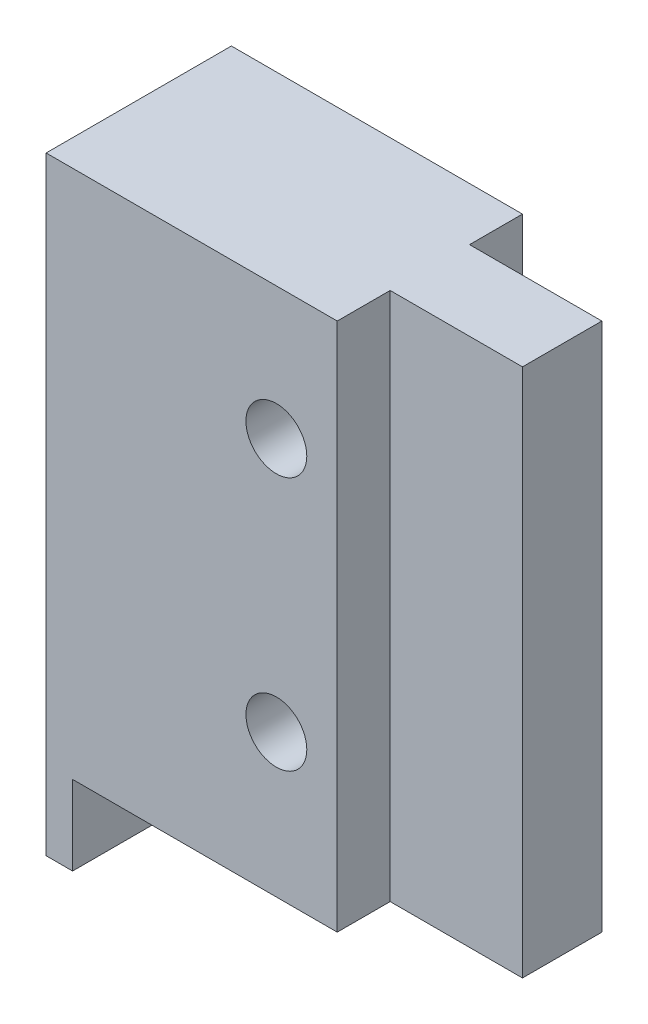
ISO-10303-21;
HEADER;
FILE_DESCRIPTION(('STEP AP214'),'2;1');
FILE_NAME('part.step','',(''),(''),'','','');
FILE_SCHEMA(('AUTOMOTIVE_DESIGN { 1 0 10303 214 1 1 1 1 }'));
ENDSEC;
DATA;
#1=APPLICATION_CONTEXT('core data for automotive mechanical design processes');
#2=APPLICATION_PROTOCOL_DEFINITION('international standard','automotive_design',2000,#1);
#3=PRODUCT_CONTEXT('',#1,'mechanical');
#4=PRODUCT('Part','Part','',(#3));
#5=PRODUCT_RELATED_PRODUCT_CATEGORY('part','',(#4));
#6=PRODUCT_DEFINITION_FORMATION('','',#4);
#7=PRODUCT_DEFINITION_CONTEXT('part definition',#1,'design');
#8=PRODUCT_DEFINITION('design','',#6,#7);
#9=PRODUCT_DEFINITION_SHAPE('','',#8);
#10=(LENGTH_UNIT() NAMED_UNIT(*) SI_UNIT(.MILLI.,.METRE.));
#11=(NAMED_UNIT(*) PLANE_ANGLE_UNIT() SI_UNIT($,.RADIAN.));
#12=(NAMED_UNIT(*) SI_UNIT($,.STERADIAN.) SOLID_ANGLE_UNIT());
#13=UNCERTAINTY_MEASURE_WITH_UNIT(LENGTH_MEASURE(1.E-05),#10,'distance_accuracy_value','');
#14=(GEOMETRIC_REPRESENTATION_CONTEXT(3) GLOBAL_UNCERTAINTY_ASSIGNED_CONTEXT((#13)) GLOBAL_UNIT_ASSIGNED_CONTEXT((#10,
#11,#12)) REPRESENTATION_CONTEXT('',''));
#15=CARTESIAN_POINT('',(0.,0.,0.));
#16=DIRECTION('',(0.,0.,1.));
#17=DIRECTION('',(1.,0.,0.));
#18=AXIS2_PLACEMENT_3D('',#15,#16,#17);
#19=CARTESIAN_POINT('',(11.,0.,-3.5));
#20=DIRECTION('',(-1.,0.,0.));
#21=DIRECTION('',(0.,-1.,0.));
#22=AXIS2_PLACEMENT_3D('',#19,#20,#21);
#23=PLANE('',#22);
#24=DIRECTION('',(0.,-1.,0.));
#25=VECTOR('',#24,1.);
#26=CARTESIAN_POINT('',(11.,0.,1.5));
#27=LINE('',#26,#25);
#28=CARTESIAN_POINT('',(11.,23.,1.5));
#29=VERTEX_POINT('',#28);
#30=CARTESIAN_POINT('',(11.,3.,1.5));
#31=VERTEX_POINT('',#30);
#32=EDGE_CURVE('E128',#29,#31,#27,.T.);
#33=ORIENTED_EDGE('',*,*,#32,.F.);
#34=DIRECTION('',(0.,0.,1.));
#35=VECTOR('',#34,1.);
#36=CARTESIAN_POINT('',(11.,23.,-3.5));
#37=LINE('',#36,#35);
#38=CARTESIAN_POINT('',(11.,23.,3.5));
#39=VERTEX_POINT('',#38);
#40=EDGE_CURVE('E140',#29,#39,#37,.T.);
#41=ORIENTED_EDGE('',*,*,#40,.T.);
#42=DIRECTION('',(0.,-1.,0.));
#43=VECTOR('',#42,1.);
#44=CARTESIAN_POINT('',(11.,0.,3.5));
#45=LINE('',#44,#43);
#46=CARTESIAN_POINT('',(11.,3.,3.5));
#47=VERTEX_POINT('',#46);
#48=EDGE_CURVE('E189',#39,#47,#45,.T.);
#49=ORIENTED_EDGE('',*,*,#48,.T.);
#50=DIRECTION('',(0.,0.,1.));
#51=VECTOR('',#50,1.);
#52=CARTESIAN_POINT('',(11.,3.,-3.5));
#53=LINE('',#52,#51);
#54=EDGE_CURVE('E51',#31,#47,#53,.T.);
#55=ORIENTED_EDGE('',*,*,#54,.F.);
#56=EDGE_LOOP('',(#33,#41,#49,#55));
#57=FACE_BOUND('',#56,.T.);
#58=ADVANCED_FACE('F41',(#57),#23,.F.);
#59=CARTESIAN_POINT('',(11.,23.,-3.5));
#60=VERTEX_POINT('',#59);
#61=CARTESIAN_POINT('',(11.,23.,-1.5));
#62=VERTEX_POINT('',#61);
#63=EDGE_CURVE('E45',#60,#62,#37,.T.);
#64=ORIENTED_EDGE('',*,*,#63,.T.);
#65=DIRECTION('',(0.,-1.,0.));
#66=VECTOR('',#65,1.);
#67=CARTESIAN_POINT('',(11.,0.,-1.5));
#68=LINE('',#67,#66);
#69=CARTESIAN_POINT('',(11.,3.,-1.5));
#70=VERTEX_POINT('',#69);
#71=EDGE_CURVE('E246',#62,#70,#68,.T.);
#72=ORIENTED_EDGE('',*,*,#71,.T.);
#73=CARTESIAN_POINT('',(11.,3.,-3.5));
#74=VERTEX_POINT('',#73);
#75=EDGE_CURVE('E11',#74,#70,#53,.T.);
#76=ORIENTED_EDGE('',*,*,#75,.F.);
#77=DIRECTION('',(0.,-1.,0.));
#78=VECTOR('',#77,1.);
#79=CARTESIAN_POINT('',(11.,0.,-3.5));
#80=LINE('',#79,#78);
#81=EDGE_CURVE('E67',#60,#74,#80,.T.);
#82=ORIENTED_EDGE('',*,*,#81,.F.);
#83=EDGE_LOOP('',(#64,#72,#76,#82));
#84=FACE_BOUND('',#83,.T.);
#85=ADVANCED_FACE('F43',(#84),#23,.F.);
#86=CARTESIAN_POINT('',(0.,3.,-3.5));
#87=DIRECTION('',(0.,-1.,0.));
#88=DIRECTION('',(0.,0.,-1.));
#89=AXIS2_PLACEMENT_3D('',#86,#87,#88);
#90=PLANE('',#89);
#91=ORIENTED_EDGE('',*,*,#75,.T.);
#92=DIRECTION('',(1.,0.,0.));
#93=VECTOR('',#92,1.);
#94=CARTESIAN_POINT('',(0.,3.,-1.5));
#95=LINE('',#94,#93);
#96=CARTESIAN_POINT('',(16.,3.,-1.5));
#97=VERTEX_POINT('',#96);
#98=EDGE_CURVE('E59',#70,#97,#95,.T.);
#99=ORIENTED_EDGE('',*,*,#98,.T.);
#100=DIRECTION('',(0.,0.,1.));
#101=VECTOR('',#100,1.);
#102=CARTESIAN_POINT('',(16.,3.,-1.5));
#103=LINE('',#102,#101);
#104=CARTESIAN_POINT('',(16.,3.,1.5));
#105=VERTEX_POINT('',#104);
#106=EDGE_CURVE('E259',#97,#105,#103,.T.);
#107=ORIENTED_EDGE('',*,*,#106,.T.);
#108=DIRECTION('',(1.,0.,0.));
#109=VECTOR('',#108,1.);
#110=CARTESIAN_POINT('',(0.,3.,1.5));
#111=LINE('',#110,#109);
#112=EDGE_CURVE('E143',#31,#105,#111,.T.);
#113=ORIENTED_EDGE('',*,*,#112,.F.);
#114=ORIENTED_EDGE('',*,*,#54,.T.);
#115=DIRECTION('',(1.,0.,0.));
#116=VECTOR('',#115,1.);
#117=CARTESIAN_POINT('',(0.,3.,3.5));
#118=LINE('',#117,#116);
#119=CARTESIAN_POINT('',(1.,3.,3.5));
#120=VERTEX_POINT('',#119);
#121=EDGE_CURVE('E205',#120,#47,#118,.T.);
#122=ORIENTED_EDGE('',*,*,#121,.F.);
#123=DIRECTION('',(0.,0.,1.));
#124=VECTOR('',#123,1.);
#125=CARTESIAN_POINT('',(1.,3.,-3.5));
#126=LINE('',#125,#124);
#127=CARTESIAN_POINT('',(1.,3.,-3.5));
#128=VERTEX_POINT('',#127);
#129=EDGE_CURVE('E166',#128,#120,#126,.T.);
#130=ORIENTED_EDGE('',*,*,#129,.F.);
#131=DIRECTION('',(1.,0.,0.));
#132=VECTOR('',#131,1.);
#133=CARTESIAN_POINT('',(0.,3.,-3.5));
#134=LINE('',#133,#132);
#135=EDGE_CURVE('E162',#128,#74,#134,.T.);
#136=ORIENTED_EDGE('',*,*,#135,.T.);
#137=EDGE_LOOP('',(#91,#99,#107,#113,#114,#122,#130,#136));
#138=FACE_BOUND('',#137,.T.);
#139=ADVANCED_FACE('F232',(#138),#90,.T.);
#140=CARTESIAN_POINT('',(1.,0.,-3.5));
#141=DIRECTION('',(-1.,0.,0.));
#142=DIRECTION('',(0.,0.,1.));
#143=AXIS2_PLACEMENT_3D('',#140,#141,#142);
#144=PLANE('',#143);
#145=ORIENTED_EDGE('',*,*,#129,.T.);
#146=DIRECTION('',(0.,-1.,0.));
#147=VECTOR('',#146,1.);
#148=CARTESIAN_POINT('',(1.,0.,3.5));
#149=LINE('',#148,#147);
#150=CARTESIAN_POINT('',(1.,0.,3.5));
#151=VERTEX_POINT('',#150);
#152=EDGE_CURVE('E198',#120,#151,#149,.T.);
#153=ORIENTED_EDGE('',*,*,#152,.T.);
#154=DIRECTION('',(0.,0.,1.));
#155=VECTOR('',#154,1.);
#156=CARTESIAN_POINT('',(1.,0.,-3.5));
#157=LINE('',#156,#155);
#158=CARTESIAN_POINT('',(1.,0.,-3.5));
#159=VERTEX_POINT('',#158);
#160=EDGE_CURVE('E169',#159,#151,#157,.T.);
#161=ORIENTED_EDGE('',*,*,#160,.F.);
#162=DIRECTION('',(0.,-1.,0.));
#163=VECTOR('',#162,1.);
#164=CARTESIAN_POINT('',(1.,0.,-3.5));
#165=LINE('',#164,#163);
#166=EDGE_CURVE('E227',#128,#159,#165,.T.);
#167=ORIENTED_EDGE('',*,*,#166,.F.);
#168=EDGE_LOOP('',(#145,#153,#161,#167));
#169=FACE_BOUND('',#168,.T.);
#170=ADVANCED_FACE('F240',(#169),#144,.F.);
#171=CARTESIAN_POINT('',(0.,0.,-3.5));
#172=DIRECTION('',(0.,-1.,0.));
#173=DIRECTION('',(0.,0.,-1.));
#174=AXIS2_PLACEMENT_3D('',#171,#172,#173);
#175=PLANE('',#174);
#176=ORIENTED_EDGE('',*,*,#160,.T.);
#177=DIRECTION('',(1.,0.,0.));
#178=VECTOR('',#177,1.);
#179=CARTESIAN_POINT('',(0.,0.,3.5));
#180=LINE('',#179,#178);
#181=CARTESIAN_POINT('',(0.,0.,3.5));
#182=VERTEX_POINT('',#181);
#183=EDGE_CURVE('E195',#182,#151,#180,.T.);
#184=ORIENTED_EDGE('',*,*,#183,.F.);
#185=DIRECTION('',(0.,0.,1.));
#186=VECTOR('',#185,1.);
#187=CARTESIAN_POINT('',(0.,0.,-3.5));
#188=LINE('',#187,#186);
#189=CARTESIAN_POINT('',(0.,0.,-3.5));
#190=VERTEX_POINT('',#189);
#191=EDGE_CURVE('E172',#190,#182,#188,.T.);
#192=ORIENTED_EDGE('',*,*,#191,.F.);
#193=DIRECTION('',(1.,0.,0.));
#194=VECTOR('',#193,1.);
#195=CARTESIAN_POINT('',(0.,0.,-3.5));
#196=LINE('',#195,#194);
#197=EDGE_CURVE('E223',#190,#159,#196,.T.);
#198=ORIENTED_EDGE('',*,*,#197,.T.);
#199=EDGE_LOOP('',(#176,#184,#192,#198));
#200=FACE_BOUND('',#199,.T.);
#201=ADVANCED_FACE('F243',(#200),#175,.T.);
#202=CARTESIAN_POINT('',(0.,0.,-3.5));
#203=DIRECTION('',(1.,0.,0.));
#204=DIRECTION('',(0.,1.,0.));
#205=AXIS2_PLACEMENT_3D('',#202,#203,#204);
#206=PLANE('',#205);
#207=ORIENTED_EDGE('',*,*,#191,.T.);
#208=DIRECTION('',(0.,1.,0.));
#209=VECTOR('',#208,1.);
#210=CARTESIAN_POINT('',(0.,0.,3.5));
#211=LINE('',#210,#209);
#212=CARTESIAN_POINT('',(0.,23.,3.5));
#213=VERTEX_POINT('',#212);
#214=EDGE_CURVE('E187',#182,#213,#211,.T.);
#215=ORIENTED_EDGE('',*,*,#214,.T.);
#216=DIRECTION('',(0.,0.,1.));
#217=VECTOR('',#216,1.);
#218=CARTESIAN_POINT('',(0.,23.,-3.5));
#219=LINE('',#218,#217);
#220=CARTESIAN_POINT('',(0.,23.,-3.5));
#221=VERTEX_POINT('',#220);
#222=EDGE_CURVE('E154',#221,#213,#219,.T.);
#223=ORIENTED_EDGE('',*,*,#222,.F.);
#224=DIRECTION('',(0.,1.,0.));
#225=VECTOR('',#224,1.);
#226=CARTESIAN_POINT('',(0.,0.,-3.5));
#227=LINE('',#226,#225);
#228=EDGE_CURVE('E220',#190,#221,#227,.T.);
#229=ORIENTED_EDGE('',*,*,#228,.F.);
#230=EDGE_LOOP('',(#207,#215,#223,#229));
#231=FACE_BOUND('',#230,.T.);
#232=ADVANCED_FACE('F192',(#231),#206,.F.);
#233=CARTESIAN_POINT('',(8.7,18.,-3.5));
#234=DIRECTION('',(0.,0.,1.));
#235=DIRECTION('',(1.,0.,0.));
#236=AXIS2_PLACEMENT_3D('',#233,#234,#235);
#237=CYLINDRICAL_SURFACE('',#236,1.15);
#238=CARTESIAN_POINT('',(8.7,18.,-3.5));
#239=DIRECTION('',(0.,0.,1.));
#240=DIRECTION('',(1.,0.,0.));
#241=AXIS2_PLACEMENT_3D('',#238,#239,#240);
#242=CIRCLE('',#241,1.15);
#243=CARTESIAN_POINT('',(9.85,18.,-3.5));
#244=VERTEX_POINT('',#243);
#245=EDGE_CURVE('E156',#244,#244,#242,.T.);
#246=ORIENTED_EDGE('',*,*,#245,.F.);
#247=EDGE_LOOP('',(#246));
#248=FACE_BOUND('',#247,.T.);
#249=CARTESIAN_POINT('',(8.7,18.,3.5));
#250=DIRECTION('',(0.,0.,1.));
#251=DIRECTION('',(1.,0.,0.));
#252=AXIS2_PLACEMENT_3D('',#249,#250,#251);
#253=CIRCLE('',#252,1.15);
#254=CARTESIAN_POINT('',(9.85,18.,3.5));
#255=VERTEX_POINT('',#254);
#256=EDGE_CURVE('E208',#255,#255,#253,.T.);
#257=ORIENTED_EDGE('',*,*,#256,.T.);
#258=EDGE_LOOP('',(#257));
#259=FACE_BOUND('',#258,.T.);
#260=ADVANCED_FACE('F292',(#248,#259),#237,.F.);
#261=CARTESIAN_POINT('',(0.,23.,-3.5));
#262=DIRECTION('',(0.,-1.,0.));
#263=DIRECTION('',(0.,0.,-1.));
#264=AXIS2_PLACEMENT_3D('',#261,#262,#263);
#265=PLANE('',#264);
#266=ORIENTED_EDGE('',*,*,#222,.T.);
#267=DIRECTION('',(1.,0.,0.));
#268=VECTOR('',#267,1.);
#269=CARTESIAN_POINT('',(0.,23.,3.5));
#270=LINE('',#269,#268);
#271=EDGE_CURVE('E148',#213,#39,#270,.T.);
#272=ORIENTED_EDGE('',*,*,#271,.T.);
#273=ORIENTED_EDGE('',*,*,#40,.F.);
#274=DIRECTION('',(1.,0.,0.));
#275=VECTOR('',#274,1.);
#276=CARTESIAN_POINT('',(0.,23.,1.5));
#277=LINE('',#276,#275);
#278=CARTESIAN_POINT('',(16.,23.,1.5));
#279=VERTEX_POINT('',#278);
#280=EDGE_CURVE('E124',#29,#279,#277,.T.);
#281=ORIENTED_EDGE('',*,*,#280,.T.);
#282=DIRECTION('',(0.,0.,1.));
#283=VECTOR('',#282,1.);
#284=CARTESIAN_POINT('',(16.,23.,-1.5));
#285=LINE('',#284,#283);
#286=CARTESIAN_POINT('',(16.,23.,-1.5));
#287=VERTEX_POINT('',#286);
#288=EDGE_CURVE('E260',#287,#279,#285,.T.);
#289=ORIENTED_EDGE('',*,*,#288,.F.);
#290=DIRECTION('',(1.,0.,0.));
#291=VECTOR('',#290,1.);
#292=CARTESIAN_POINT('',(0.,23.,-1.5));
#293=LINE('',#292,#291);
#294=EDGE_CURVE('E244',#62,#287,#293,.T.);
#295=ORIENTED_EDGE('',*,*,#294,.F.);
#296=ORIENTED_EDGE('',*,*,#63,.F.);
#297=DIRECTION('',(1.,0.,0.));
#298=VECTOR('',#297,1.);
#299=CARTESIAN_POINT('',(0.,23.,-3.5));
#300=LINE('',#299,#298);
#301=EDGE_CURVE('E178',#221,#60,#300,.T.);
#302=ORIENTED_EDGE('',*,*,#301,.F.);
#303=EDGE_LOOP('',(#266,#272,#273,#281,#289,#295,#296,#302));
#304=FACE_BOUND('',#303,.T.);
#305=ADVANCED_FACE('F146',(#304),#265,.F.);
#306=CARTESIAN_POINT('',(8.7,8.4,-3.5));
#307=DIRECTION('',(0.,0.,1.));
#308=DIRECTION('',(1.,0.,0.));
#309=AXIS2_PLACEMENT_3D('',#306,#307,#308);
#310=CYLINDRICAL_SURFACE('',#309,1.15);
#311=CARTESIAN_POINT('',(8.7,8.4,-3.5));
#312=DIRECTION('',(0.,0.,1.));
#313=DIRECTION('',(1.,0.,0.));
#314=AXIS2_PLACEMENT_3D('',#311,#312,#313);
#315=CIRCLE('',#314,1.15);
#316=CARTESIAN_POINT('',(9.85,8.4,-3.5));
#317=VERTEX_POINT('',#316);
#318=EDGE_CURVE('E150',#317,#317,#315,.F.);
#319=ORIENTED_EDGE('',*,*,#318,.T.);
#320=EDGE_LOOP('',(#319));
#321=FACE_BOUND('',#320,.T.);
#322=CARTESIAN_POINT('',(8.7,8.4,3.5));
#323=DIRECTION('',(0.,0.,1.));
#324=DIRECTION('',(1.,0.,0.));
#325=AXIS2_PLACEMENT_3D('',#322,#323,#324);
#326=CIRCLE('',#325,1.15);
#327=CARTESIAN_POINT('',(9.85,8.4,3.5));
#328=VERTEX_POINT('',#327);
#329=EDGE_CURVE('E212',#328,#328,#326,.F.);
#330=ORIENTED_EDGE('',*,*,#329,.F.);
#331=EDGE_LOOP('',(#330));
#332=FACE_BOUND('',#331,.T.);
#333=ADVANCED_FACE('F299',(#321,#332),#310,.F.);
#334=CARTESIAN_POINT('',(0.,0.,-3.5));
#335=DIRECTION('',(0.,0.,1.));
#336=DIRECTION('',(1.,0.,0.));
#337=AXIS2_PLACEMENT_3D('',#334,#335,#336);
#338=PLANE('',#337);
#339=ORIENTED_EDGE('',*,*,#81,.T.);
#340=ORIENTED_EDGE('',*,*,#135,.F.);
#341=ORIENTED_EDGE('',*,*,#166,.T.);
#342=ORIENTED_EDGE('',*,*,#197,.F.);
#343=ORIENTED_EDGE('',*,*,#228,.T.);
#344=ORIENTED_EDGE('',*,*,#301,.T.);
#345=EDGE_LOOP('',(#339,#340,#341,#342,#343,#344));
#346=FACE_BOUND('',#345,.T.);
#347=ORIENTED_EDGE('',*,*,#245,.T.);
#348=EDGE_LOOP('',(#347));
#349=FACE_BOUND('',#348,.T.);
#350=ORIENTED_EDGE('',*,*,#318,.F.);
#351=EDGE_LOOP('',(#350));
#352=FACE_BOUND('',#351,.T.);
#353=ADVANCED_FACE('F235',(#346,#349,#352),#338,.F.);
#354=CARTESIAN_POINT('',(0.,0.,3.5));
#355=DIRECTION('',(0.,0.,1.));
#356=DIRECTION('',(1.,0.,0.));
#357=AXIS2_PLACEMENT_3D('',#354,#355,#356);
#358=PLANE('',#357);
#359=ORIENTED_EDGE('',*,*,#48,.F.);
#360=ORIENTED_EDGE('',*,*,#271,.F.);
#361=ORIENTED_EDGE('',*,*,#214,.F.);
#362=ORIENTED_EDGE('',*,*,#183,.T.);
#363=ORIENTED_EDGE('',*,*,#152,.F.);
#364=ORIENTED_EDGE('',*,*,#121,.T.);
#365=EDGE_LOOP('',(#359,#360,#361,#362,#363,#364));
#366=FACE_BOUND('',#365,.T.);
#367=ORIENTED_EDGE('',*,*,#256,.F.);
#368=EDGE_LOOP('',(#367));
#369=FACE_BOUND('',#368,.T.);
#370=ORIENTED_EDGE('',*,*,#329,.T.);
#371=EDGE_LOOP('',(#370));
#372=FACE_BOUND('',#371,.T.);
#373=ADVANCED_FACE('F184',(#366,#369,#372),#358,.T.);
#374=CARTESIAN_POINT('',(16.,0.,-1.5));
#375=DIRECTION('',(1.,0.,0.));
#376=DIRECTION('',(0.,1.,0.));
#377=AXIS2_PLACEMENT_3D('',#374,#375,#376);
#378=PLANE('',#377);
#379=ORIENTED_EDGE('',*,*,#288,.T.);
#380=DIRECTION('',(0.,1.,0.));
#381=VECTOR('',#380,1.);
#382=CARTESIAN_POINT('',(16.,0.,1.5));
#383=LINE('',#382,#381);
#384=EDGE_CURVE('E131',#105,#279,#383,.T.);
#385=ORIENTED_EDGE('',*,*,#384,.F.);
#386=ORIENTED_EDGE('',*,*,#106,.F.);
#387=DIRECTION('',(0.,1.,0.));
#388=VECTOR('',#387,1.);
#389=CARTESIAN_POINT('',(16.,0.,-1.5));
#390=LINE('',#389,#388);
#391=EDGE_CURVE('E251',#97,#287,#390,.T.);
#392=ORIENTED_EDGE('',*,*,#391,.T.);
#393=EDGE_LOOP('',(#379,#385,#386,#392));
#394=FACE_BOUND('',#393,.T.);
#395=ADVANCED_FACE('F268',(#394),#378,.T.);
#396=CARTESIAN_POINT('',(0.,0.,-1.5));
#397=DIRECTION('',(0.,0.,1.));
#398=DIRECTION('',(1.,0.,0.));
#399=AXIS2_PLACEMENT_3D('',#396,#397,#398);
#400=PLANE('',#399);
#401=ORIENTED_EDGE('',*,*,#294,.T.);
#402=ORIENTED_EDGE('',*,*,#391,.F.);
#403=ORIENTED_EDGE('',*,*,#98,.F.);
#404=ORIENTED_EDGE('',*,*,#71,.F.);
#405=EDGE_LOOP('',(#401,#402,#403,#404));
#406=FACE_BOUND('',#405,.T.);
#407=ADVANCED_FACE('F270',(#406),#400,.F.);
#408=CARTESIAN_POINT('',(0.,0.,1.5));
#409=DIRECTION('',(0.,0.,1.));
#410=DIRECTION('',(1.,0.,0.));
#411=AXIS2_PLACEMENT_3D('',#408,#409,#410);
#412=PLANE('',#411);
#413=ORIENTED_EDGE('',*,*,#280,.F.);
#414=ORIENTED_EDGE('',*,*,#32,.T.);
#415=ORIENTED_EDGE('',*,*,#112,.T.);
#416=ORIENTED_EDGE('',*,*,#384,.T.);
#417=EDGE_LOOP('',(#413,#414,#415,#416));
#418=FACE_BOUND('',#417,.T.);
#419=ADVANCED_FACE('F126',(#418),#412,.T.);
#420=CLOSED_SHELL('',(#58,#85,#139,#170,#201,#232,#260,#305,#333,#353,#373,#395,#407,#419));
#421=MANIFOLD_SOLID_BREP('B2',#420);
#422=ADVANCED_BREP_SHAPE_REPRESENTATION('',(#18,#421),#14);
#423=SHAPE_DEFINITION_REPRESENTATION(#9,#422);
ENDSEC;
END-ISO-10303-21;
